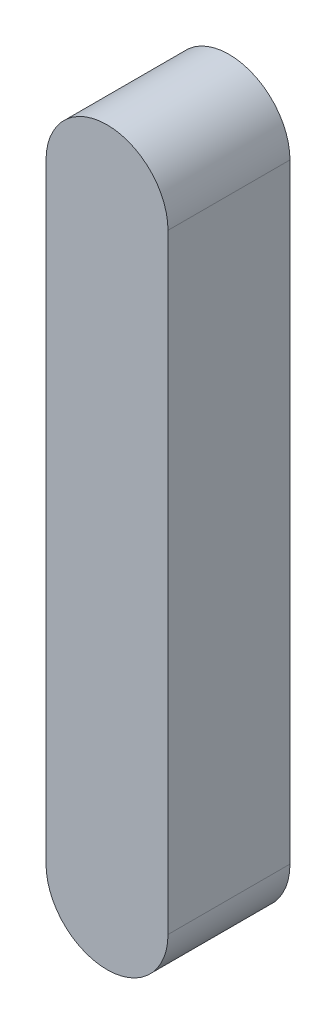
ISO-10303-21;
HEADER;
FILE_DESCRIPTION(('STEP AP214'),'2;1');
FILE_NAME('part.step','',(''),(''),'','','');
FILE_SCHEMA(('AUTOMOTIVE_DESIGN { 1 0 10303 214 1 1 1 1 }'));
ENDSEC;
DATA;
#1=APPLICATION_CONTEXT('core data for automotive mechanical design processes');
#2=APPLICATION_PROTOCOL_DEFINITION('international standard','automotive_design',2000,#1);
#3=PRODUCT_CONTEXT('',#1,'mechanical');
#4=PRODUCT('Part','Part','',(#3));
#5=PRODUCT_RELATED_PRODUCT_CATEGORY('part','',(#4));
#6=PRODUCT_DEFINITION_FORMATION('','',#4);
#7=PRODUCT_DEFINITION_CONTEXT('part definition',#1,'design');
#8=PRODUCT_DEFINITION('design','',#6,#7);
#9=PRODUCT_DEFINITION_SHAPE('','',#8);
#10=(LENGTH_UNIT() NAMED_UNIT(*) SI_UNIT(.MILLI.,.METRE.));
#11=(NAMED_UNIT(*) PLANE_ANGLE_UNIT() SI_UNIT($,.RADIAN.));
#12=(NAMED_UNIT(*) SI_UNIT($,.STERADIAN.) SOLID_ANGLE_UNIT());
#13=UNCERTAINTY_MEASURE_WITH_UNIT(LENGTH_MEASURE(1.E-05),#10,'distance_accuracy_value','');
#14=(GEOMETRIC_REPRESENTATION_CONTEXT(3) GLOBAL_UNCERTAINTY_ASSIGNED_CONTEXT((#13)) GLOBAL_UNIT_ASSIGNED_CONTEXT((#10,
#11,#12)) REPRESENTATION_CONTEXT('',''));
#15=CARTESIAN_POINT('',(0.,0.,0.));
#16=DIRECTION('',(0.,0.,1.));
#17=DIRECTION('',(1.,0.,0.));
#18=AXIS2_PLACEMENT_3D('',#15,#16,#17);
#19=CARTESIAN_POINT('',(0.,-5.000000033,-1.000000032));
#20=DIRECTION('',(0.,0.,1.));
#21=DIRECTION('',(1.,0.,0.));
#22=AXIS2_PLACEMENT_3D('',#19,#20,#21);
#23=PLANE('',#22);
#24=CARTESIAN_POINT('',(0.,-5.000000033,-1.000000032));
#25=DIRECTION('',(0.,0.,1.));
#26=DIRECTION('',(1.,0.,0.));
#27=AXIS2_PLACEMENT_3D('',#24,#25,#26);
#28=CIRCLE('',#27,1.000000032);
#29=CARTESIAN_POINT('',(-1.000000032,-5.000000033,-1.000000032));
#30=VERTEX_POINT('',#29);
#31=CARTESIAN_POINT('',(1.000000032,-5.000000033,-1.000000032));
#32=VERTEX_POINT('',#31);
#33=EDGE_CURVE('E111',#30,#32,#28,.T.);
#34=ORIENTED_EDGE('',*,*,#33,.F.);
#35=DIRECTION('',(0.,-1.,0.));
#36=VECTOR('',#35,1.);
#37=CARTESIAN_POINT('',(-1.000000032,-5.000000033,-1.000000032));
#38=LINE('',#37,#36);
#39=CARTESIAN_POINT('',(-1.000000032,5.000000033,-1.000000032));
#40=VERTEX_POINT('',#39);
#41=EDGE_CURVE('E19',#40,#30,#38,.T.);
#42=ORIENTED_EDGE('',*,*,#41,.F.);
#43=CARTESIAN_POINT('',(0.,5.000000033,-1.000000032));
#44=DIRECTION('',(0.,0.,1.));
#45=DIRECTION('',(1.,0.,0.));
#46=AXIS2_PLACEMENT_3D('',#43,#44,#45);
#47=CIRCLE('',#46,1.000000032);
#48=CARTESIAN_POINT('',(1.000000032,5.000000033,-1.000000032));
#49=VERTEX_POINT('',#48);
#50=EDGE_CURVE('E94',#49,#40,#47,.T.);
#51=ORIENTED_EDGE('',*,*,#50,.F.);
#52=DIRECTION('',(0.,1.,0.));
#53=VECTOR('',#52,1.);
#54=CARTESIAN_POINT('',(1.000000032,-5.000000033,-1.000000032));
#55=LINE('',#54,#53);
#56=EDGE_CURVE('E71',#32,#49,#55,.T.);
#57=ORIENTED_EDGE('',*,*,#56,.F.);
#58=EDGE_LOOP('',(#34,#42,#51,#57));
#59=FACE_BOUND('',#58,.T.);
#60=ADVANCED_FACE('F16',(#59),#23,.F.);
#61=CARTESIAN_POINT('',(0.,-5.000000033,1.000000032));
#62=DIRECTION('',(0.,0.,1.));
#63=DIRECTION('',(1.,0.,0.));
#64=AXIS2_PLACEMENT_3D('',#61,#62,#63);
#65=PLANE('',#64);
#66=CARTESIAN_POINT('',(0.,-5.000000033,1.000000032));
#67=DIRECTION('',(0.,0.,1.));
#68=DIRECTION('',(1.,0.,0.));
#69=AXIS2_PLACEMENT_3D('',#66,#67,#68);
#70=CIRCLE('',#69,1.000000032);
#71=CARTESIAN_POINT('',(-1.000000032,-5.000000033,1.000000032));
#72=VERTEX_POINT('',#71);
#73=CARTESIAN_POINT('',(1.000000032,-5.000000033,1.000000032));
#74=VERTEX_POINT('',#73);
#75=EDGE_CURVE('E93',#72,#74,#70,.T.);
#76=ORIENTED_EDGE('',*,*,#75,.T.);
#77=DIRECTION('',(0.,1.,0.));
#78=VECTOR('',#77,1.);
#79=CARTESIAN_POINT('',(1.000000032,-5.000000033,1.000000032));
#80=LINE('',#79,#78);
#81=CARTESIAN_POINT('',(1.000000032,5.000000033,1.000000032));
#82=VERTEX_POINT('',#81);
#83=EDGE_CURVE('E64',#74,#82,#80,.T.);
#84=ORIENTED_EDGE('',*,*,#83,.T.);
#85=CARTESIAN_POINT('',(0.,5.000000033,1.000000032));
#86=DIRECTION('',(0.,0.,1.));
#87=DIRECTION('',(1.,0.,0.));
#88=AXIS2_PLACEMENT_3D('',#85,#86,#87);
#89=CIRCLE('',#88,1.000000032);
#90=CARTESIAN_POINT('',(-1.000000032,5.000000033,1.000000032));
#91=VERTEX_POINT('',#90);
#92=EDGE_CURVE('E83',#82,#91,#89,.T.);
#93=ORIENTED_EDGE('',*,*,#92,.T.);
#94=DIRECTION('',(0.,-1.,0.));
#95=VECTOR('',#94,1.);
#96=CARTESIAN_POINT('',(-1.000000032,-5.000000033,1.000000032));
#97=LINE('',#96,#95);
#98=EDGE_CURVE('E11',#91,#72,#97,.T.);
#99=ORIENTED_EDGE('',*,*,#98,.T.);
#100=EDGE_LOOP('',(#76,#84,#93,#99));
#101=FACE_BOUND('',#100,.T.);
#102=ADVANCED_FACE('F90',(#101),#65,.T.);
#103=CARTESIAN_POINT('',(-1.000000032,-5.000000033,1.000000032));
#104=DIRECTION('',(1.,0.,0.));
#105=DIRECTION('',(0.,1.,0.));
#106=AXIS2_PLACEMENT_3D('',#103,#104,#105);
#107=PLANE('',#106);
#108=ORIENTED_EDGE('',*,*,#41,.T.);
#109=DIRECTION('',(0.,0.,-1.));
#110=VECTOR('',#109,1.);
#111=CARTESIAN_POINT('',(-1.000000032,-5.000000033,1.000000032));
#112=LINE('',#111,#110);
#113=EDGE_CURVE('E103',#72,#30,#112,.T.);
#114=ORIENTED_EDGE('',*,*,#113,.F.);
#115=ORIENTED_EDGE('',*,*,#98,.F.);
#116=DIRECTION('',(0.,0.,-1.));
#117=VECTOR('',#116,1.);
#118=CARTESIAN_POINT('',(-1.000000032,5.000000033,1.000000032));
#119=LINE('',#118,#117);
#120=EDGE_CURVE('E87',#91,#40,#119,.T.);
#121=ORIENTED_EDGE('',*,*,#120,.T.);
#122=EDGE_LOOP('',(#108,#114,#115,#121));
#123=FACE_BOUND('',#122,.T.);
#124=ADVANCED_FACE('F112',(#123),#107,.F.);
#125=CARTESIAN_POINT('',(0.,5.000000033,1.000000032));
#126=DIRECTION('',(0.,0.,-1.));
#127=DIRECTION('',(-1.,0.,0.));
#128=AXIS2_PLACEMENT_3D('',#125,#126,#127);
#129=CYLINDRICAL_SURFACE('',#128,1.000000032);
#130=ORIENTED_EDGE('',*,*,#50,.T.);
#131=ORIENTED_EDGE('',*,*,#120,.F.);
#132=ORIENTED_EDGE('',*,*,#92,.F.);
#133=DIRECTION('',(0.,0.,-1.));
#134=VECTOR('',#133,1.);
#135=CARTESIAN_POINT('',(1.000000032,5.000000033,1.000000032));
#136=LINE('',#135,#134);
#137=EDGE_CURVE('E88',#82,#49,#136,.T.);
#138=ORIENTED_EDGE('',*,*,#137,.T.);
#139=EDGE_LOOP('',(#130,#131,#132,#138));
#140=FACE_BOUND('',#139,.T.);
#141=ADVANCED_FACE('F84',(#140),#129,.T.);
#142=CARTESIAN_POINT('',(1.000000032,-5.000000033,1.000000032));
#143=DIRECTION('',(-1.,0.,0.));
#144=DIRECTION('',(0.,1.,0.));
#145=AXIS2_PLACEMENT_3D('',#142,#143,#144);
#146=PLANE('',#145);
#147=ORIENTED_EDGE('',*,*,#56,.T.);
#148=ORIENTED_EDGE('',*,*,#137,.F.);
#149=ORIENTED_EDGE('',*,*,#83,.F.);
#150=DIRECTION('',(0.,0.,-1.));
#151=VECTOR('',#150,1.);
#152=CARTESIAN_POINT('',(1.000000032,-5.000000033,1.000000032));
#153=LINE('',#152,#151);
#154=EDGE_CURVE('E166',#74,#32,#153,.T.);
#155=ORIENTED_EDGE('',*,*,#154,.T.);
#156=EDGE_LOOP('',(#147,#148,#149,#155));
#157=FACE_BOUND('',#156,.T.);
#158=ADVANCED_FACE('F96',(#157),#146,.F.);
#159=CARTESIAN_POINT('',(0.,-5.000000033,1.000000032));
#160=DIRECTION('',(0.,0.,-1.));
#161=DIRECTION('',(-1.,0.,0.));
#162=AXIS2_PLACEMENT_3D('',#159,#160,#161);
#163=CYLINDRICAL_SURFACE('',#162,1.000000032);
#164=ORIENTED_EDGE('',*,*,#33,.T.);
#165=ORIENTED_EDGE('',*,*,#154,.F.);
#166=ORIENTED_EDGE('',*,*,#75,.F.);
#167=ORIENTED_EDGE('',*,*,#113,.T.);
#168=EDGE_LOOP('',(#164,#165,#166,#167));
#169=FACE_BOUND('',#168,.T.);
#170=ADVANCED_FACE('F188',(#169),#163,.T.);
#171=CLOSED_SHELL('',(#60,#102,#124,#141,#158,#170));
#172=MANIFOLD_SOLID_BREP('B1',#171);
#173=ADVANCED_BREP_SHAPE_REPRESENTATION('',(#18,#172),#14);
#174=SHAPE_DEFINITION_REPRESENTATION(#9,#173);
ENDSEC;
END-ISO-10303-21;
